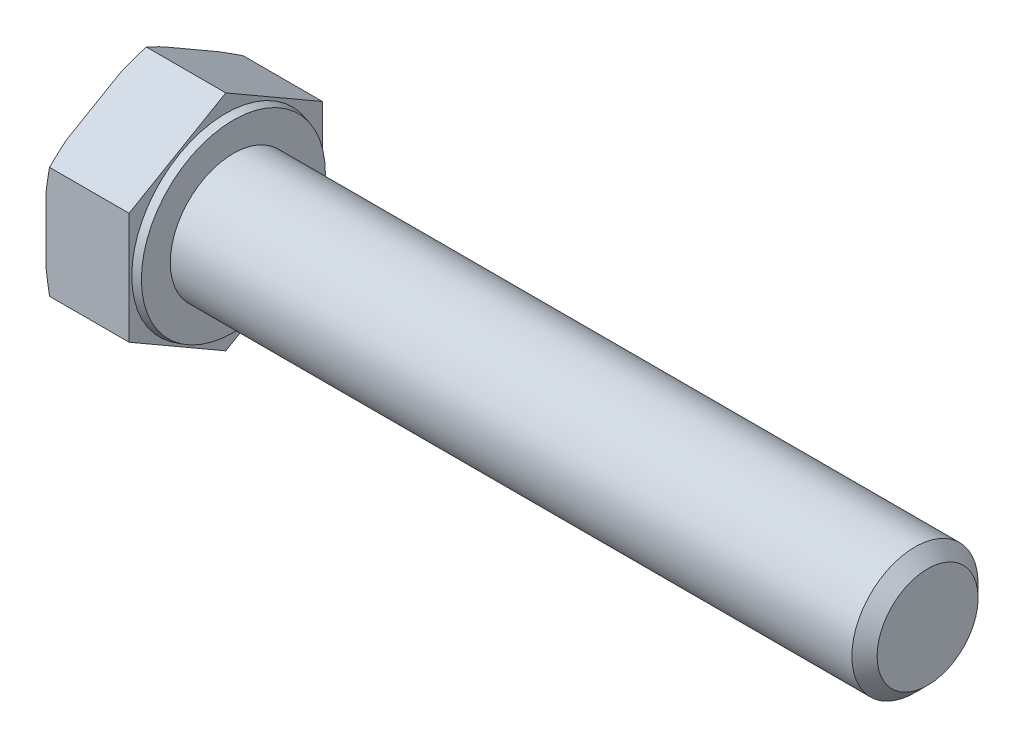
ISO-10303-21;
HEADER;
FILE_DESCRIPTION(('STEP AP214'),'2;1');
FILE_NAME('part.step','',(''),(''),'','','');
FILE_SCHEMA(('AUTOMOTIVE_DESIGN { 1 0 10303 214 1 1 1 1 }'));
ENDSEC;
DATA;
#1=APPLICATION_CONTEXT('core data for automotive mechanical design processes');
#2=APPLICATION_PROTOCOL_DEFINITION('international standard','automotive_design',2000,#1);
#3=PRODUCT_CONTEXT('',#1,'mechanical');
#4=PRODUCT('Part','Part','',(#3));
#5=PRODUCT_RELATED_PRODUCT_CATEGORY('part','',(#4));
#6=PRODUCT_DEFINITION_FORMATION('','',#4);
#7=PRODUCT_DEFINITION_CONTEXT('part definition',#1,'design');
#8=PRODUCT_DEFINITION('design','',#6,#7);
#9=PRODUCT_DEFINITION_SHAPE('','',#8);
#10=(LENGTH_UNIT() NAMED_UNIT(*) SI_UNIT(.MILLI.,.METRE.));
#11=(NAMED_UNIT(*) PLANE_ANGLE_UNIT() SI_UNIT($,.RADIAN.));
#12=(NAMED_UNIT(*) SI_UNIT($,.STERADIAN.) SOLID_ANGLE_UNIT());
#13=UNCERTAINTY_MEASURE_WITH_UNIT(LENGTH_MEASURE(1.E-05),#10,'distance_accuracy_value','');
#14=(GEOMETRIC_REPRESENTATION_CONTEXT(3) GLOBAL_UNCERTAINTY_ASSIGNED_CONTEXT((#13)) GLOBAL_UNIT_ASSIGNED_CONTEXT((#10,
#11,#12)) REPRESENTATION_CONTEXT('',''));
#15=CARTESIAN_POINT('',(0.,0.,0.));
#16=DIRECTION('',(0.,0.,1.));
#17=DIRECTION('',(1.,0.,0.));
#18=AXIS2_PLACEMENT_3D('',#15,#16,#17);
#19=CARTESIAN_POINT('',(55.6000000000001,-4.42500000000009,-7.66432482349223));
#20=DIRECTION('',(0.,-0.866025403784441,-0.499999999999995));
#21=DIRECTION('',(0.,0.499999999999995,-0.866025403784442));
#22=AXIS2_PLACEMENT_3D('',#19,#20,#21);
#23=PLANE('',#22);
#24=DIRECTION('',(-1.,0.,0.));
#25=VECTOR('',#24,1.);
#26=CARTESIAN_POINT('',(55.6000000000001,-8.85,0.));
#27=LINE('',#26,#25);
#28=CARTESIAN_POINT('',(0.,-8.85,0.));
#29=VERTEX_POINT('',#28);
#30=CARTESIAN_POINT('',(-6.29792306844368,-8.85,0.));
#31=VERTEX_POINT('',#30);
#32=EDGE_CURVE('E158',#29,#31,#27,.T.);
#33=ORIENTED_EDGE('',*,*,#32,.T.);
#34=CARTESIAN_POINT('',(-4.7699615006699,-11.9174022332107,5.3128965151713));
#35=CARTESIAN_POINT('',(-4.83614833570257,-11.8050473190038,5.11829209528478));
#36=CARTESIAN_POINT('',(-4.90167255003095,-11.6925948603644,4.92351872348535));
#37=CARTESIAN_POINT('',(-5.03118559698242,-11.4674663528304,4.53358471020429));
#38=CARTESIAN_POINT('',(-5.09517439305191,-11.3547902986816,4.33842405962226));
#39=CARTESIAN_POINT('',(-5.28456041407139,-11.0163157536771,3.75216895060564));
#40=CARTESIAN_POINT('',(-5.40733223857273,-10.7901468045143,3.3604328395613));
#41=CARTESIAN_POINT('',(-5.64480594732521,-10.3342684187143,2.57082831328319));
#42=CARTESIAN_POINT('',(-5.75941225873481,-10.1045464495324,2.17293819104532));
#43=CARTESIAN_POINT('',(-5.97591685440881,-9.6436033227612,1.37456127607789));
#44=CARTESIAN_POINT('',(-6.07781581130404,-9.41238224520544,0.974074621970503));
#45=CARTESIAN_POINT('',(-6.26134144326315,-8.95638364479248,0.184261877874948));
#46=CARTESIAN_POINT('',(-6.34355573274743,-8.73166601658844,-0.204960471530832));
#47=CARTESIAN_POINT('',(-6.48746045966098,-8.28055127837509,-0.986314118159494));
#48=CARTESIAN_POINT('',(-6.54915189984519,-8.05415425097466,-1.37844527229961));
#49=CARTESIAN_POINT('',(-6.62254434564547,-7.71410474496151,-1.9674282938031));
#50=CARTESIAN_POINT('',(-6.64378861584913,-7.60095958105454,-2.16340146632069));
#51=CARTESIAN_POINT('',(-6.67950592063896,-7.37440457175731,-2.55580625313272));
#52=CARTESIAN_POINT('',(-6.69397933196105,-7.26099474144627,-2.75223784130922));
#53=CARTESIAN_POINT('',(-6.7157765759338,-7.03401139991638,-3.14538452131075));
#54=CARTESIAN_POINT('',(-6.72310096885371,-6.92043790222291,-3.34209958970915));
#55=CARTESIAN_POINT('',(-6.73040192529393,-6.69323186195545,-3.73563199523894));
#56=CARTESIAN_POINT('',(-6.73037853713207,-6.57959931977464,-3.93244933168932));
#57=CARTESIAN_POINT('',(-6.72320871548941,-6.35929562962563,-4.31402651612232));
#58=CARTESIAN_POINT('',(-6.71649505277964,-6.25262090601261,-4.49879255730344));
#59=CARTESIAN_POINT('',(-6.69675463432834,-6.03941600442701,-4.86807427927243));
#60=CARTESIAN_POINT('',(-6.68372760236287,-5.93288583298343,-5.05258994875172));
#61=CARTESIAN_POINT('',(-6.63559663675346,-5.61363013252953,-5.60555704254388));
#62=CARTESIAN_POINT('',(-6.59144268713134,-5.40123548697151,-5.97343535990596));
#63=CARTESIAN_POINT('',(-6.48226269320506,-4.97681311893132,-6.70855646522027));
#64=CARTESIAN_POINT('',(-6.41713860156276,-4.7647919199632,-7.07578795411474));
#65=CARTESIAN_POINT('',(-6.27018625376656,-4.34222339340586,-7.80769811179158));
#66=CARTESIAN_POINT('',(-6.18835790112246,-4.1316760743376,-8.17237676581522));
#67=CARTESIAN_POINT('',(-6.00866271800198,-3.70472589760515,-8.91187616421634));
#68=CARTESIAN_POINT('',(-5.91033992742069,-3.48837165185492,-9.286612710289));
#69=CARTESIAN_POINT('',(-5.70311989656312,-3.05693413716248,-10.0338844060276));
#70=CARTESIAN_POINT('',(-5.59422212603359,-2.84185093252738,-10.4064194443103));
#71=CARTESIAN_POINT('',(-5.36943684134144,-2.41473283183158,-11.1462096955477));
#72=CARTESIAN_POINT('',(-5.25362330968472,-2.2026881429877,-11.5134818701005));
#73=CARTESIAN_POINT('',(-5.07537550670142,-1.88529185166038,-12.0632283728133));
#74=CARTESIAN_POINT('',(-5.01521325258259,-1.77961882394802,-12.2462594258008));
#75=CARTESIAN_POINT('',(-4.89354912869936,-1.56846779942573,-12.6119837283436));
#76=CARTESIAN_POINT('',(-4.83204728425027,-1.462989798971,-12.794676984212));
#77=CARTESIAN_POINT('',(-4.7699615006699,-1.35759776678936,-12.9772213386635));
#78=B_SPLINE_CURVE_WITH_KNOTS('',3,(#34,#35,#36,#37,#38,#39,#40,#41,#42,#43,#44,#45,#46,#47,#48,
#49,#50,#51,#52,#53,#54,#55,#56,#57,#58,#59,#60,#61,#62,#63,#64,#65,#66,#67,#68,#69,#70,#71,#72,
#73,#74,#75,#76,#77),.UNSPECIFIED.,.F.,.F.,(4,2,2,2,2,2,2,2,2,2,2,2,2,2,2,2,2,2,2,2,2,4),(0.,
0.70276173034238,1.40554017472233,2.81157217612387,4.23201032618944,5.6523732571052,
7.02270828812482,8.39297635416767,9.07474696516834,9.75647963740092,10.438158877887,
11.119833635759,11.7601005309412,12.4003954417532,13.6809617128842,14.9676044823533,
16.2542546841745,17.5852978857349,18.9164078632869,20.2352036230902,20.894426976119,
21.553637882061),.UNSPECIFIED.);
#79=CARTESIAN_POINT('',(-6.58000000000003,-7.90869530364146,-1.63038755949604));
#80=VERTEX_POINT('',#79);
#81=EDGE_CURVE('E203',#31,#80,#78,.T.);
#82=ORIENTED_EDGE('',*,*,#81,.T.);
#83=DIRECTION('',(0.,-0.499999999999995,0.866025403784442));
#84=VECTOR('',#83,1.);
#85=CARTESIAN_POINT('',(-6.58,-4.42500000000009,-7.66432482349223));
#86=LINE('',#85,#84);
#87=CARTESIAN_POINT('',(-6.58,-5.36630469635854,-6.03393726399618));
#88=VERTEX_POINT('',#87);
#89=EDGE_CURVE('E213',#88,#80,#86,.T.);
#90=ORIENTED_EDGE('',*,*,#89,.F.);
#91=CARTESIAN_POINT('',(-6.29792306844368,-4.42500000000009,-7.66432482349223));
#92=VERTEX_POINT('',#91);
#93=EDGE_CURVE('E216',#88,#92,#78,.T.);
#94=ORIENTED_EDGE('',*,*,#93,.T.);
#95=DIRECTION('',(-1.,0.,0.));
#96=VECTOR('',#95,1.);
#97=CARTESIAN_POINT('',(55.6000000000001,-4.42500000000009,-7.66432482349223));
#98=LINE('',#97,#96);
#99=CARTESIAN_POINT('',(0.,-4.42500000000009,-7.66432482349223));
#100=VERTEX_POINT('',#99);
#101=EDGE_CURVE('E169',#100,#92,#98,.T.);
#102=ORIENTED_EDGE('',*,*,#101,.F.);
#103=DIRECTION('',(0.,-0.499999999999995,0.866025403784442));
#104=VECTOR('',#103,1.);
#105=CARTESIAN_POINT('',(0.,-4.42500000000009,-7.66432482349223));
#106=LINE('',#105,#104);
#107=EDGE_CURVE('E184',#100,#29,#106,.T.);
#108=ORIENTED_EDGE('',*,*,#107,.T.);
#109=EDGE_LOOP('',(#33,#82,#90,#94,#102,#108));
#110=FACE_BOUND('',#109,.T.);
#111=ADVANCED_FACE('F36',(#110),#23,.T.);
#112=CARTESIAN_POINT('',(55.6000000000001,4.42499999999993,-7.66432482349232));
#113=DIRECTION('',(0.,0.,-1.));
#114=DIRECTION('',(0.,1.,0.));
#115=AXIS2_PLACEMENT_3D('',#112,#113,#114);
#116=PLANE('',#115);
#117=ORIENTED_EDGE('',*,*,#101,.T.);
#118=CARTESIAN_POINT('',(-5.00864005639831,-9.73789651517145,-7.66432482349217));
#119=CARTESIAN_POINT('',(-5.07003318744064,-9.52322769233334,-7.66432482349218));
#120=CARTESIAN_POINT('',(-5.13071664914256,-9.30835600664128,-7.66432482349218));
#121=CARTESIAN_POINT('',(-5.2504442425723,-8.87815277711283,-7.66432482349218));
#122=CARTESIAN_POINT('',(-5.30948834652955,-8.66282122555281,-7.66432482349219));
#123=CARTESIAN_POINT('',(-5.48387527888684,-8.01589307910885,-7.66432482349219));
#124=CARTESIAN_POINT('',(-5.59642298983084,-7.58353558067021,-7.6643248234922));
#125=CARTESIAN_POINT('',(-5.81266226723173,-6.71259000391773,-7.66432482349221));
#126=CARTESIAN_POINT('',(-5.91626806915323,-6.27398046842187,-7.66432482349221));
#127=CARTESIAN_POINT('',(-6.11029091280608,-5.39384656433909,-7.66432482349222));
#128=CARTESIAN_POINT('',(-6.20070892550878,-4.95232241284974,-7.66432482349222));
#129=CARTESIAN_POINT('',(-6.36160933963008,-4.08051166755351,-7.66432482349223));
#130=CARTESIAN_POINT('',(-6.43264625776086,-3.65032885049375,-7.66432482349224));
#131=CARTESIAN_POINT('',(-6.55428187483288,-2.78707107422335,-7.66432482349225));
#132=CARTESIAN_POINT('',(-6.60488453148917,-2.35399669158535,-7.66432482349225));
#133=CARTESIAN_POINT('',(-6.66240831794471,-1.70368188145931,-7.66432482349226));
#134=CARTESIAN_POINT('',(-6.67850532779577,-1.48723464984804,-7.66432482349226));
#135=CARTESIAN_POINT('',(-6.70429433272965,-1.05396299728827,-7.66432482349227));
#136=CARTESIAN_POINT('',(-6.71398664875919,-0.837138595786226,-7.66432482349227));
#137=CARTESIAN_POINT('',(-6.72672253024382,-0.403302294793051,-7.66432482349227));
#138=CARTESIAN_POINT('',(-6.72976638437883,-0.186290403852155,-7.66432482349227));
#139=CARTESIAN_POINT('',(-6.7291358967764,0.247718950123678,-7.66432482349228));
#140=CARTESIAN_POINT('',(-6.72546155695146,0.464716413162706,-7.66432482349228));
#141=CARTESIAN_POINT('',(-6.70624362970486,1.06036953223341,-7.66432482349229));
#142=CARTESIAN_POINT('',(-6.68388895075078,1.43882252598365,-7.66432482349229));
#143=CARTESIAN_POINT('',(-6.62050559151052,2.19412494594648,-7.6643248234923));
#144=CARTESIAN_POINT('',(-6.57947609181733,2.57097430106276,-7.6643248234923));
#145=CARTESIAN_POINT('',(-6.48113797206862,3.32388976987407,-7.66432482349231));
#146=CARTESIAN_POINT('',(-6.4237712185853,3.69994816672772,-7.66432482349232));
#147=CARTESIAN_POINT('',(-6.2956564145037,4.44978573942378,-7.66432482349232));
#148=CARTESIAN_POINT('',(-6.22490691200718,4.82356466341955,-7.66432482349233));
#149=CARTESIAN_POINT('',(-6.0704014797458,5.58003633732887,-7.66432482349234));
#150=CARTESIAN_POINT('',(-5.98632024183774,5.96266195818458,-7.66432482349234));
#151=CARTESIAN_POINT('',(-5.80919867667365,6.72583533235177,-7.66432482349235));
#152=CARTESIAN_POINT('',(-5.71615790531566,7.10638298167437,-7.66432482349235));
#153=CARTESIAN_POINT('',(-5.52374117974904,7.86297645537245,-7.66432482349236));
#154=CARTESIAN_POINT('',(-5.42441511026811,8.23903503370974,-7.66432482349236));
#155=CARTESIAN_POINT('',(-5.27134102225385,8.80195695976291,-7.66432482349237));
#156=CARTESIAN_POINT('',(-5.21964171692946,8.98938164843282,-7.66432482349237));
#157=CARTESIAN_POINT('',(-5.11502150400523,9.36388780999383,-7.66432482349237));
#158=CARTESIAN_POINT('',(-5.06210060924165,9.55096928646908,-7.66432482349238));
#159=CARTESIAN_POINT('',(-5.00864005639831,9.73789651517129,-7.66432482349238));
#160=B_SPLINE_CURVE_WITH_KNOTS('',3,(#118,#119,#120,#121,#122,#123,#124,#125,#126,#127,#128,
#129,#130,#131,#132,#133,#134,#135,#136,#137,#138,#139,#140,#141,#142,#143,#144,#145,#146,#147,
#148,#149,#150,#151,#152,#153,#154,#155,#156,#157,#158,#159),.UNSPECIFIED.,.F.,.F.,(4,2,2,2,2,2,
2,2,2,2,2,2,2,2,2,2,2,2,2,2,4),(0.,0.669823290546161,1.33965792092904,2.67986595636369,
4.03175825312792,5.38355096443301,6.69120700403605,7.99860965473741,8.64966414612008,
9.300686009923,9.95167960543101,10.6026730156168,11.7394565125237,12.876289893615,
14.0172201663474,15.1582742899967,16.3334026116279,17.5085892114817,18.6753990362947,
19.2586689197893,19.8419326771629),.UNSPECIFIED.);
#161=CARTESIAN_POINT('',(-6.58000000000003,-2.54239060728318,-7.66432482349217));
#162=VERTEX_POINT('',#161);
#163=EDGE_CURVE('E224',#92,#162,#160,.T.);
#164=ORIENTED_EDGE('',*,*,#163,.T.);
#165=DIRECTION('',(0.,-1.,0.));
#166=VECTOR('',#165,1.);
#167=CARTESIAN_POINT('',(-6.58,4.42499999999993,-7.66432482349232));
#168=LINE('',#167,#166);
#169=CARTESIAN_POINT('',(-6.58,2.54239060728305,-7.6643248234923));
#170=VERTEX_POINT('',#169);
#171=EDGE_CURVE('E164',#170,#162,#168,.T.);
#172=ORIENTED_EDGE('',*,*,#171,.F.);
#173=CARTESIAN_POINT('',(-6.29792306844368,4.42499999999993,-7.66432482349232));
#174=VERTEX_POINT('',#173);
#175=EDGE_CURVE('E51',#170,#174,#160,.T.);
#176=ORIENTED_EDGE('',*,*,#175,.T.);
#177=DIRECTION('',(-1.,0.,0.));
#178=VECTOR('',#177,1.);
#179=CARTESIAN_POINT('',(55.6000000000001,4.42499999999993,-7.66432482349232));
#180=LINE('',#179,#178);
#181=CARTESIAN_POINT('',(0.,4.42499999999993,-7.66432482349232));
#182=VERTEX_POINT('',#181);
#183=EDGE_CURVE('E155',#182,#174,#180,.T.);
#184=ORIENTED_EDGE('',*,*,#183,.F.);
#185=DIRECTION('',(0.,-1.,0.));
#186=VECTOR('',#185,1.);
#187=CARTESIAN_POINT('',(0.,8.84999999999992,-7.66432482349237));
#188=LINE('',#187,#186);
#189=EDGE_CURVE('E182',#182,#100,#188,.T.);
#190=ORIENTED_EDGE('',*,*,#189,.T.);
#191=EDGE_LOOP('',(#117,#164,#172,#176,#184,#190));
#192=FACE_BOUND('',#191,.T.);
#193=ADVANCED_FACE('F251',(#192),#116,.T.);
#194=CARTESIAN_POINT('',(55.6000000000001,8.85,0.));
#195=DIRECTION('',(0.,0.866025403784435,-0.500000000000007));
#196=DIRECTION('',(0.,0.500000000000007,0.866025403784434));
#197=AXIS2_PLACEMENT_3D('',#194,#195,#196);
#198=PLANE('',#197);
#199=ORIENTED_EDGE('',*,*,#183,.T.);
#200=CARTESIAN_POINT('',(-4.76996150066986,1.35759776678906,-12.9772213386637));
#201=CARTESIAN_POINT('',(-4.83614833570253,1.46995268099604,-12.7826169187772));
#202=CARTESIAN_POINT('',(-4.90167255003091,1.58240513963541,-12.5878435469777));
#203=CARTESIAN_POINT('',(-5.03118559698238,1.80753364716943,-12.1979095336967));
#204=CARTESIAN_POINT('',(-5.09517439305187,1.92020970131819,-12.0027488831146));
#205=CARTESIAN_POINT('',(-5.28456041407135,2.25868424632273,-11.416493774098));
#206=CARTESIAN_POINT('',(-5.40733223857269,2.48485319548548,-11.0247576630537));
#207=CARTESIAN_POINT('',(-5.64480594732518,2.94073158128551,-10.2351531367756));
#208=CARTESIAN_POINT('',(-5.75941225873478,3.17045355046743,-9.83726301453771));
#209=CARTESIAN_POINT('',(-5.97591685440879,3.63139667723867,-9.03888609957028));
#210=CARTESIAN_POINT('',(-6.07781581130402,3.86261775479443,-8.63839944546289));
#211=CARTESIAN_POINT('',(-6.26134144326313,4.31861635520741,-7.84858670136733));
#212=CARTESIAN_POINT('',(-6.34355573274742,4.54333398341145,-7.45936435196155));
#213=CARTESIAN_POINT('',(-6.48746045966097,4.99444872162482,-6.67801070533289));
#214=CARTESIAN_POINT('',(-6.54915189984519,5.22084574902526,-6.28587955119277));
#215=CARTESIAN_POINT('',(-6.62254434564547,5.56089525503842,-5.69689652968929));
#216=CARTESIAN_POINT('',(-6.64378861584913,5.6740404189454,-5.5009233571717));
#217=CARTESIAN_POINT('',(-6.67950592063896,5.90059542824263,-5.10851857035966));
#218=CARTESIAN_POINT('',(-6.69397933196106,6.01400525855368,-4.91208698218316));
#219=CARTESIAN_POINT('',(-6.7157765759338,6.24098860008357,-4.51894030218163));
#220=CARTESIAN_POINT('',(-6.72310096885372,6.35456209777704,-4.32222523378324));
#221=CARTESIAN_POINT('',(-6.73040192529394,6.58176813804451,-3.92869282825345));
#222=CARTESIAN_POINT('',(-6.73037853713208,6.69540068022533,-3.73187549180306));
#223=CARTESIAN_POINT('',(-6.72320871548943,6.91570437037435,-3.35029830737006));
#224=CARTESIAN_POINT('',(-6.71649505277966,7.02237909398737,-3.16553226618894));
#225=CARTESIAN_POINT('',(-6.69675463432836,7.23558399557298,-2.79625054421994));
#226=CARTESIAN_POINT('',(-6.68372760236289,7.34211416701656,-2.61173487474064));
#227=CARTESIAN_POINT('',(-6.63559663675348,7.66136986747048,-2.05876778094847));
#228=CARTESIAN_POINT('',(-6.59144268713136,7.87376451302851,-1.69088946358639));
#229=CARTESIAN_POINT('',(-6.48226269320508,8.29818688106872,-0.955768358272067));
#230=CARTESIAN_POINT('',(-6.41713860156277,8.51020808003686,-0.588536869377595));
#231=CARTESIAN_POINT('',(-6.27018625376657,8.93277660659422,0.143373288299261));
#232=CARTESIAN_POINT('',(-6.18835790112246,9.14332392566248,0.508051942322905));
#233=CARTESIAN_POINT('',(-6.00866271800198,9.57027410239495,1.24755134072404));
#234=CARTESIAN_POINT('',(-5.91033992742068,9.7866283481452,1.62228788679671));
#235=CARTESIAN_POINT('',(-5.7031198965631,10.2180658628377,2.36955958253528));
#236=CARTESIAN_POINT('',(-5.59422212603357,10.4331490674728,2.74209462081801));
#237=CARTESIAN_POINT('',(-5.36943684134141,10.8602671681686,3.48188487205548));
#238=CARTESIAN_POINT('',(-5.25362330968469,11.0723118570125,3.84915704660823));
#239=CARTESIAN_POINT('',(-5.07537550670138,11.3897081483398,4.39890354932111));
#240=CARTESIAN_POINT('',(-5.01521325258256,11.4953811760522,4.58193460230855));
#241=CARTESIAN_POINT('',(-4.89354912869932,11.7065322005745,4.94765890485139));
#242=CARTESIAN_POINT('',(-4.83204728425022,11.8120102010292,5.13035216071975));
#243=CARTESIAN_POINT('',(-4.76996150066986,11.9174022332109,5.3128965151713));
#244=B_SPLINE_CURVE_WITH_KNOTS('',3,(#200,#201,#202,#203,#204,#205,#206,#207,#208,#209,#210,
#211,#212,#213,#214,#215,#216,#217,#218,#219,#220,#221,#222,#223,#224,#225,#226,#227,#228,#229,
#230,#231,#232,#233,#234,#235,#236,#237,#238,#239,#240,#241,#242,#243),.UNSPECIFIED.,.F.,.F.,(4,
2,2,2,2,2,2,2,2,2,2,2,2,2,2,2,2,2,2,2,2,4),(0.,0.702761730342389,1.40554017472235,
2.8115721761239,4.23201032618948,5.65237325710526,7.02270828812488,8.39297635416774,
9.07474696516842,9.75647963740101,10.4381588778871,11.1198336357591,11.7601005309413,
12.4003954417533,13.6809617128843,14.9676044823535,16.2542546841748,17.5852978857351,
18.9164078632872,20.2352036230905,20.8944269761194,21.5536378820614),.UNSPECIFIED.);
#245=CARTESIAN_POINT('',(-6.58000000000003,5.36630469635833,-6.03393726399625));
#246=VERTEX_POINT('',#245);
#247=EDGE_CURVE('E246',#174,#246,#244,.T.);
#248=ORIENTED_EDGE('',*,*,#247,.T.);
#249=DIRECTION('',(0.,-0.500000000000007,-0.866025403784435));
#250=VECTOR('',#249,1.);
#251=CARTESIAN_POINT('',(-6.58,8.85,0.));
#252=LINE('',#251,#250);
#253=CARTESIAN_POINT('',(-6.58,7.90869530364155,-1.63038755949607));
#254=VERTEX_POINT('',#253);
#255=EDGE_CURVE('E236',#254,#246,#252,.T.);
#256=ORIENTED_EDGE('',*,*,#255,.F.);
#257=CARTESIAN_POINT('',(-6.29792306844368,8.85,0.));
#258=VERTEX_POINT('',#257);
#259=EDGE_CURVE('E59',#254,#258,#244,.T.);
#260=ORIENTED_EDGE('',*,*,#259,.T.);
#261=DIRECTION('',(-1.,0.,0.));
#262=VECTOR('',#261,1.);
#263=CARTESIAN_POINT('',(55.6000000000001,8.85,0.));
#264=LINE('',#263,#262);
#265=CARTESIAN_POINT('',(0.,8.85,0.));
#266=VERTEX_POINT('',#265);
#267=EDGE_CURVE('E152',#266,#258,#264,.T.);
#268=ORIENTED_EDGE('',*,*,#267,.F.);
#269=DIRECTION('',(0.,-0.500000000000007,-0.866025403784434));
#270=VECTOR('',#269,1.);
#271=CARTESIAN_POINT('',(0.,8.85000000000003,0.));
#272=LINE('',#271,#270);
#273=EDGE_CURVE('E180',#266,#182,#272,.T.);
#274=ORIENTED_EDGE('',*,*,#273,.T.);
#275=EDGE_LOOP('',(#199,#248,#256,#260,#268,#274));
#276=FACE_BOUND('',#275,.T.);
#277=ADVANCED_FACE('F244',(#276),#198,.T.);
#278=CARTESIAN_POINT('',(55.6000000000001,4.42500000000004,7.66432482349226));
#279=DIRECTION('',(0.,0.866025403784441,0.499999999999995));
#280=DIRECTION('',(0.,-0.499999999999995,0.866025403784442));
#281=AXIS2_PLACEMENT_3D('',#278,#279,#280);
#282=PLANE('',#281);
#283=ORIENTED_EDGE('',*,*,#267,.T.);
#284=CARTESIAN_POINT('',(-4.76996150066987,11.9174022332108,-5.31289651517143));
#285=CARTESIAN_POINT('',(-4.83614833570254,11.8050473190038,-5.1182920952849));
#286=CARTESIAN_POINT('',(-4.90167255003092,11.6925948603644,-4.92351872348547));
#287=CARTESIAN_POINT('',(-5.03118559698239,11.4674663528304,-4.53358471020441));
#288=CARTESIAN_POINT('',(-5.09517439305188,11.3547902986817,-4.33842405962238));
#289=CARTESIAN_POINT('',(-5.28456041407136,11.0163157536771,-3.75216895060575));
#290=CARTESIAN_POINT('',(-5.40733223857271,10.7901468045144,-3.36043283956142));
#291=CARTESIAN_POINT('',(-5.64480594732519,10.3342684187144,-2.5708283132833));
#292=CARTESIAN_POINT('',(-5.75941225873479,10.1045464495324,-2.17293819104544));
#293=CARTESIAN_POINT('',(-5.9759168544088,9.64360332276122,-1.374561276078));
#294=CARTESIAN_POINT('',(-6.07781581130403,9.41238224520547,-0.974074621970606));
#295=CARTESIAN_POINT('',(-6.26134144326314,8.95638364479251,-0.184261877875046));
#296=CARTESIAN_POINT('',(-6.34355573274742,8.73166601658846,0.204960471530735));
#297=CARTESIAN_POINT('',(-6.48746045966097,8.28055127837511,0.986314118159402));
#298=CARTESIAN_POINT('',(-6.54915189984519,8.05415425097468,1.37844527229952));
#299=CARTESIAN_POINT('',(-6.62254434564547,7.71410474496153,1.96742829380301));
#300=CARTESIAN_POINT('',(-6.64378861584914,7.60095958105455,2.1634014663206));
#301=CARTESIAN_POINT('',(-6.67950592063896,7.37440457175733,2.55580625313264));
#302=CARTESIAN_POINT('',(-6.69397933196106,7.26099474144628,2.75223784130914));
#303=CARTESIAN_POINT('',(-6.7157765759338,7.03401139991639,3.14538452131067));
#304=CARTESIAN_POINT('',(-6.72310096885372,6.92043790222292,3.34209958970907));
#305=CARTESIAN_POINT('',(-6.73040192529394,6.69323186195546,3.73563199523886));
#306=CARTESIAN_POINT('',(-6.73037853713208,6.57959931977464,3.93244933168925));
#307=CARTESIAN_POINT('',(-6.72320871548943,6.35929562962563,4.31402651612225));
#308=CARTESIAN_POINT('',(-6.71649505277966,6.25262090601261,4.49879255730337));
#309=CARTESIAN_POINT('',(-6.69675463432836,6.03941600442701,4.86807427927237));
#310=CARTESIAN_POINT('',(-6.68372760236289,5.93288583298343,5.05258994875167));
#311=CARTESIAN_POINT('',(-6.63559663675348,5.61363013252952,5.60555704254384));
#312=CARTESIAN_POINT('',(-6.59144268713136,5.40123548697149,5.97343535990593));
#313=CARTESIAN_POINT('',(-6.48226269320508,4.9768131189313,6.70855646522025));
#314=CARTESIAN_POINT('',(-6.41713860156277,4.76479191996317,7.07578795411472));
#315=CARTESIAN_POINT('',(-6.27018625376657,4.34222339340582,7.80769811179158));
#316=CARTESIAN_POINT('',(-6.18835790112247,4.13167607433757,8.17237676581522));
#317=CARTESIAN_POINT('',(-6.00866271800198,3.70472589760511,8.91187616421636));
#318=CARTESIAN_POINT('',(-5.91033992742069,3.48837165185487,9.28661271028903));
#319=CARTESIAN_POINT('',(-5.70311989656311,3.05693413716242,10.0338844060276));
#320=CARTESIAN_POINT('',(-5.59422212603358,2.84185093252732,10.4064194443103));
#321=CARTESIAN_POINT('',(-5.36943684134142,2.41473283183151,11.1462096955478));
#322=CARTESIAN_POINT('',(-5.2536233096847,2.20268814298763,11.5134818701005));
#323=CARTESIAN_POINT('',(-5.07537550670139,1.88529185166029,12.0632283728134));
#324=CARTESIAN_POINT('',(-5.01521325258257,1.77961882394794,12.2462594258009));
#325=CARTESIAN_POINT('',(-4.89354912869933,1.56846779942564,12.6119837283437));
#326=CARTESIAN_POINT('',(-4.83204728425024,1.46298979897091,12.7946769842121));
#327=CARTESIAN_POINT('',(-4.76996150066987,1.35759776678927,12.9772213386636));
#328=B_SPLINE_CURVE_WITH_KNOTS('',3,(#284,#285,#286,#287,#288,#289,#290,#291,#292,#293,#294,
#295,#296,#297,#298,#299,#300,#301,#302,#303,#304,#305,#306,#307,#308,#309,#310,#311,#312,#313,
#314,#315,#316,#317,#318,#319,#320,#321,#322,#323,#324,#325,#326,#327),.UNSPECIFIED.,.F.,.F.,(4,
2,2,2,2,2,2,2,2,2,2,2,2,2,2,2,2,2,2,2,2,4),(0.,0.702761730342385,1.40554017472234,
2.81157217612389,4.23201032618946,5.65237325710524,7.02270828812486,8.39297635416772,
9.07474696516839,9.75647963740098,10.4381588778871,11.119833635759,11.7601005309412,
12.4003954417533,13.6809617128843,14.9676044823535,16.2542546841747,17.585297885735,
18.9164078632871,20.2352036230904,20.8944269761193,21.5536378820612),.UNSPECIFIED.);
#329=CARTESIAN_POINT('',(-6.58000000000003,7.90869530364148,1.63038755949594));
#330=VERTEX_POINT('',#329);
#331=EDGE_CURVE('E146',#258,#330,#328,.T.);
#332=ORIENTED_EDGE('',*,*,#331,.T.);
#333=DIRECTION('',(0.,0.499999999999995,-0.866025403784442));
#334=VECTOR('',#333,1.);
#335=CARTESIAN_POINT('',(-6.58,4.42500000000004,7.66432482349226));
#336=LINE('',#335,#334);
#337=CARTESIAN_POINT('',(-6.58,5.36630469635847,6.03393726399624));
#338=VERTEX_POINT('',#337);
#339=EDGE_CURVE('E145',#338,#330,#336,.T.);
#340=ORIENTED_EDGE('',*,*,#339,.F.);
#341=CARTESIAN_POINT('',(-6.29792306844368,4.42500000000004,7.66432482349226));
#342=VERTEX_POINT('',#341);
#343=EDGE_CURVE('E127',#338,#342,#328,.T.);
#344=ORIENTED_EDGE('',*,*,#343,.T.);
#345=DIRECTION('',(-1.,0.,0.));
#346=VECTOR('',#345,1.);
#347=CARTESIAN_POINT('',(55.6000000000001,4.42500000000004,7.66432482349226));
#348=LINE('',#347,#346);
#349=CARTESIAN_POINT('',(0.,4.42500000000004,7.66432482349226));
#350=VERTEX_POINT('',#349);
#351=EDGE_CURVE('E141',#350,#342,#348,.T.);
#352=ORIENTED_EDGE('',*,*,#351,.F.);
#353=DIRECTION('',(0.,0.499999999999995,-0.866025403784442));
#354=VECTOR('',#353,1.);
#355=CARTESIAN_POINT('',(0.,8.84999999999997,0.));
#356=LINE('',#355,#354);
#357=EDGE_CURVE('E178',#350,#266,#356,.T.);
#358=ORIENTED_EDGE('',*,*,#357,.T.);
#359=EDGE_LOOP('',(#283,#332,#340,#344,#352,#358));
#360=FACE_BOUND('',#359,.T.);
#361=ADVANCED_FACE('F140',(#360),#282,.T.);
#362=CARTESIAN_POINT('',(55.6000000000001,-4.42499999999998,7.66432482349229));
#363=DIRECTION('',(0.,0.,1.));
#364=DIRECTION('',(0.,-1.,0.));
#365=AXIS2_PLACEMENT_3D('',#362,#363,#364);
#366=PLANE('',#365);
#367=ORIENTED_EDGE('',*,*,#351,.T.);
#368=CARTESIAN_POINT('',(-5.00864005639831,9.7378965151714,7.66432482349224));
#369=CARTESIAN_POINT('',(-5.07003318744064,9.52322769233328,7.66432482349224));
#370=CARTESIAN_POINT('',(-5.13071664914256,9.30835600664122,7.66432482349224));
#371=CARTESIAN_POINT('',(-5.2504442425723,8.87815277711278,7.66432482349225));
#372=CARTESIAN_POINT('',(-5.30948834652955,8.66282122555276,7.66432482349225));
#373=CARTESIAN_POINT('',(-5.48387527888684,8.0158930791088,7.66432482349225));
#374=CARTESIAN_POINT('',(-5.59642298983084,7.58353558067016,7.66432482349225));
#375=CARTESIAN_POINT('',(-5.81266226723173,6.71259000391768,7.66432482349225));
#376=CARTESIAN_POINT('',(-5.91626806915323,6.27398046842182,7.66432482349225));
#377=CARTESIAN_POINT('',(-6.11029091280608,5.39384656433903,7.66432482349226));
#378=CARTESIAN_POINT('',(-6.20070892550878,4.95232241284969,7.66432482349226));
#379=CARTESIAN_POINT('',(-6.36160933963008,4.08051166755345,7.66432482349226));
#380=CARTESIAN_POINT('',(-6.43264625776087,3.6503288504937,7.66432482349226));
#381=CARTESIAN_POINT('',(-6.55428187483288,2.7870710742233,7.66432482349227));
#382=CARTESIAN_POINT('',(-6.60488453148917,2.3539966915853,7.66432482349227));
#383=CARTESIAN_POINT('',(-6.66240831794471,1.70368188145926,7.66432482349227));
#384=CARTESIAN_POINT('',(-6.67850532779577,1.48723464984798,7.66432482349227));
#385=CARTESIAN_POINT('',(-6.70429433272965,1.05396299728821,7.66432482349227));
#386=CARTESIAN_POINT('',(-6.71398664875919,0.83713859578617,7.66432482349227));
#387=CARTESIAN_POINT('',(-6.72672253024382,0.403302294792995,7.66432482349227));
#388=CARTESIAN_POINT('',(-6.72976638437883,0.1862904038521,7.66432482349228));
#389=CARTESIAN_POINT('',(-6.7291358967764,-0.247718950123733,7.66432482349228));
#390=CARTESIAN_POINT('',(-6.72546155695146,-0.46471641316276,7.66432482349228));
#391=CARTESIAN_POINT('',(-6.70624362970486,-1.06036953223346,7.66432482349228));
#392=CARTESIAN_POINT('',(-6.68388895075078,-1.43882252598371,7.66432482349228));
#393=CARTESIAN_POINT('',(-6.62050559151052,-2.19412494594653,7.66432482349228));
#394=CARTESIAN_POINT('',(-6.57947609181733,-2.57097430106281,7.66432482349229));
#395=CARTESIAN_POINT('',(-6.48113797206862,-3.32388976987413,7.66432482349229));
#396=CARTESIAN_POINT('',(-6.4237712185853,-3.69994816672777,7.66432482349229));
#397=CARTESIAN_POINT('',(-6.2956564145037,-4.44978573942384,7.66432482349229));
#398=CARTESIAN_POINT('',(-6.22490691200718,-4.8235646634196,7.66432482349229));
#399=CARTESIAN_POINT('',(-6.0704014797458,-5.58003633732892,7.6643248234923));
#400=CARTESIAN_POINT('',(-5.98632024183774,-5.96266195818463,7.6643248234923));
#401=CARTESIAN_POINT('',(-5.80919867667365,-6.72583533235183,7.6643248234923));
#402=CARTESIAN_POINT('',(-5.71615790531566,-7.10638298167442,7.6643248234923));
#403=CARTESIAN_POINT('',(-5.52374117974904,-7.8629764553725,7.66432482349231));
#404=CARTESIAN_POINT('',(-5.42441511026811,-8.2390350337098,7.66432482349231));
#405=CARTESIAN_POINT('',(-5.27134102225385,-8.80195695976297,7.66432482349231));
#406=CARTESIAN_POINT('',(-5.21964171692946,-8.98938164843288,7.66432482349231));
#407=CARTESIAN_POINT('',(-5.11502150400523,-9.36388780999389,7.66432482349231));
#408=CARTESIAN_POINT('',(-5.06210060924165,-9.55096928646914,7.66432482349231));
#409=CARTESIAN_POINT('',(-5.00864005639831,-9.73789651517135,7.66432482349231));
#410=B_SPLINE_CURVE_WITH_KNOTS('',3,(#368,#369,#370,#371,#372,#373,#374,#375,#376,#377,#378,
#379,#380,#381,#382,#383,#384,#385,#386,#387,#388,#389,#390,#391,#392,#393,#394,#395,#396,#397,
#398,#399,#400,#401,#402,#403,#404,#405,#406,#407,#408,#409),.UNSPECIFIED.,.F.,.F.,(4,2,2,2,2,2,
2,2,2,2,2,2,2,2,2,2,2,2,2,2,4),(0.,0.669823290546161,1.33965792092904,2.67986595636369,
4.03175825312792,5.38355096443301,6.69120700403605,7.99860965473742,8.64966414612009,
9.300686009923,9.95167960543102,10.6026730156168,11.7394565125237,12.876289893615,
14.0172201663474,15.1582742899967,16.3334026116279,17.5085892114817,18.6753990362947,
19.2586689197893,19.8419326771629),.UNSPECIFIED.);
#411=CARTESIAN_POINT('',(-6.58000000000003,2.54239060728313,7.66432482349219));
#412=VERTEX_POINT('',#411);
#413=EDGE_CURVE('E124',#342,#412,#410,.T.);
#414=ORIENTED_EDGE('',*,*,#413,.T.);
#415=DIRECTION('',(0.,1.,0.));
#416=VECTOR('',#415,1.);
#417=CARTESIAN_POINT('',(-6.58,-4.42499999999998,7.66432482349229));
#418=LINE('',#417,#416);
#419=CARTESIAN_POINT('',(-6.58,-2.5423906072831,7.66432482349229));
#420=VERTEX_POINT('',#419);
#421=EDGE_CURVE('E222',#420,#412,#418,.T.);
#422=ORIENTED_EDGE('',*,*,#421,.F.);
#423=CARTESIAN_POINT('',(-6.29792306844368,-4.42499999999998,7.66432482349229));
#424=VERTEX_POINT('',#423);
#425=EDGE_CURVE('E134',#420,#424,#410,.T.);
#426=ORIENTED_EDGE('',*,*,#425,.T.);
#427=DIRECTION('',(-1.,0.,0.));
#428=VECTOR('',#427,1.);
#429=CARTESIAN_POINT('',(55.6000000000001,-4.42499999999998,7.66432482349229));
#430=LINE('',#429,#428);
#431=CARTESIAN_POINT('',(0.,-4.42499999999998,7.66432482349229));
#432=VERTEX_POINT('',#431);
#433=EDGE_CURVE('E153',#432,#424,#430,.T.);
#434=ORIENTED_EDGE('',*,*,#433,.F.);
#435=DIRECTION('',(0.,1.,0.));
#436=VECTOR('',#435,1.);
#437=CARTESIAN_POINT('',(0.,8.85000000000003,7.66432482349225));
#438=LINE('',#437,#436);
#439=EDGE_CURVE('E151',#432,#350,#438,.T.);
#440=ORIENTED_EDGE('',*,*,#439,.T.);
#441=EDGE_LOOP('',(#367,#414,#422,#426,#434,#440));
#442=FACE_BOUND('',#441,.T.);
#443=ADVANCED_FACE('F148',(#442),#366,.T.);
#444=CARTESIAN_POINT('',(55.6000000000001,-8.85,0.));
#445=DIRECTION('',(0.,-0.866025403784438,0.500000000000001));
#446=DIRECTION('',(0.,-0.500000000000001,-0.866025403784438));
#447=AXIS2_PLACEMENT_3D('',#444,#445,#446);
#448=PLANE('',#447);
#449=ORIENTED_EDGE('',*,*,#433,.T.);
#450=CARTESIAN_POINT('',(-4.76996150066987,-1.35759776678916,12.9772213386637));
#451=CARTESIAN_POINT('',(-4.83614833570253,-1.46995268099614,12.7826169187771));
#452=CARTESIAN_POINT('',(-4.90167255003091,-1.58240513963551,12.5878435469777));
#453=CARTESIAN_POINT('',(-5.03118559698239,-1.80753364716952,12.1979095336966));
#454=CARTESIAN_POINT('',(-5.09517439305187,-1.92020970131828,12.0027488831146));
#455=CARTESIAN_POINT('',(-5.28456041407135,-2.25868424632282,11.416493774098));
#456=CARTESIAN_POINT('',(-5.4073322385727,-2.48485319548557,11.0247576630537));
#457=CARTESIAN_POINT('',(-5.64480594732518,-2.94073158128559,10.2351531367755));
#458=CARTESIAN_POINT('',(-5.75941225873479,-3.17045355046751,9.83726301453767));
#459=CARTESIAN_POINT('',(-5.97591685440879,-3.63139667723874,9.03888609957024));
#460=CARTESIAN_POINT('',(-6.07781581130402,-3.8626177547945,8.63839944546285));
#461=CARTESIAN_POINT('',(-6.26134144326314,-4.31861635520747,7.84858670136729));
#462=CARTESIAN_POINT('',(-6.34355573274742,-4.54333398341151,7.45936435196151));
#463=CARTESIAN_POINT('',(-6.48746045966097,-4.99444872162487,6.67801070533285));
#464=CARTESIAN_POINT('',(-6.54915189984519,-5.22084574902531,6.28587955119273));
#465=CARTESIAN_POINT('',(-6.62254434564547,-5.56089525503846,5.69689652968924));
#466=CARTESIAN_POINT('',(-6.64378861584913,-5.67404041894544,5.50092335717165));
#467=CARTESIAN_POINT('',(-6.67950592063896,-5.90059542824267,5.10851857035961));
#468=CARTESIAN_POINT('',(-6.69397933196106,-6.01400525855371,4.91208698218312));
#469=CARTESIAN_POINT('',(-6.7157765759338,-6.24098860008361,4.51894030218158));
#470=CARTESIAN_POINT('',(-6.72310096885372,-6.35456209777708,4.32222523378319));
#471=CARTESIAN_POINT('',(-6.73040192529394,-6.58176813804454,3.92869282825339));
#472=CARTESIAN_POINT('',(-6.73037853713208,-6.69540068022536,3.73187549180301));
#473=CARTESIAN_POINT('',(-6.72320871548943,-6.91570437037438,3.35029830737001));
#474=CARTESIAN_POINT('',(-6.71649505277966,-7.0223790939874,3.16553226618888));
#475=CARTESIAN_POINT('',(-6.69675463432836,-7.235583995573,2.79625054421989));
#476=CARTESIAN_POINT('',(-6.68372760236289,-7.34211416701658,2.61173487474059));
#477=CARTESIAN_POINT('',(-6.63559663675348,-7.6613698674705,2.05876778094842));
#478=CARTESIAN_POINT('',(-6.59144268713136,-7.87376451302853,1.69088946358633));
#479=CARTESIAN_POINT('',(-6.48226269320508,-8.29818688106872,0.955768358272013));
#480=CARTESIAN_POINT('',(-6.41713860156277,-8.51020808003686,0.58853686937754));
#481=CARTESIAN_POINT('',(-6.27018625376657,-8.93277660659421,-0.143373288299316));
#482=CARTESIAN_POINT('',(-6.18835790112247,-9.14332392566247,-0.508051942322961));
#483=CARTESIAN_POINT('',(-6.00866271800198,-9.57027410239494,-1.2475513407241));
#484=CARTESIAN_POINT('',(-5.91033992742068,-9.78662834814518,-1.62228788679676));
#485=CARTESIAN_POINT('',(-5.70311989656311,-10.2180658628376,-2.36955958253533));
#486=CARTESIAN_POINT('',(-5.59422212603357,-10.4331490674727,-2.74209462081807));
#487=CARTESIAN_POINT('',(-5.36943684134142,-10.8602671681686,-3.48188487205554));
#488=CARTESIAN_POINT('',(-5.25362330968469,-11.0723118570124,-3.84915704660829));
#489=CARTESIAN_POINT('',(-5.07537550670139,-11.3897081483398,-4.39890354932117));
#490=CARTESIAN_POINT('',(-5.01521325258256,-11.4953811760521,-4.58193460230861));
#491=CARTESIAN_POINT('',(-4.89354912869932,-11.7065322005744,-4.94765890485144));
#492=CARTESIAN_POINT('',(-4.83204728425023,-11.8120102010292,-5.13035216071981));
#493=CARTESIAN_POINT('',(-4.76996150066987,-11.9174022332108,-5.31289651517136));
#494=B_SPLINE_CURVE_WITH_KNOTS('',3,(#450,#451,#452,#453,#454,#455,#456,#457,#458,#459,#460,
#461,#462,#463,#464,#465,#466,#467,#468,#469,#470,#471,#472,#473,#474,#475,#476,#477,#478,#479,
#480,#481,#482,#483,#484,#485,#486,#487,#488,#489,#490,#491,#492,#493),.UNSPECIFIED.,.F.,.F.,(4,
2,2,2,2,2,2,2,2,2,2,2,2,2,2,2,2,2,2,2,2,4),(0.,0.702761730342388,1.40554017472235,
2.81157217612389,4.23201032618948,5.65237325710525,7.02270828812487,8.39297635416773,
9.07474696516841,9.75647963740099,10.4381588778871,11.1198336357591,11.7601005309413,
12.4003954417533,13.6809617128843,14.9676044823535,16.2542546841747,17.5852978857351,
18.9164078632871,20.2352036230904,20.8944269761193,21.5536378820613),.UNSPECIFIED.);
#495=CARTESIAN_POINT('',(-6.58000000000003,-5.36630469635837,6.03393726399621));
#496=VERTEX_POINT('',#495);
#497=EDGE_CURVE('E214',#424,#496,#494,.T.);
#498=ORIENTED_EDGE('',*,*,#497,.T.);
#499=DIRECTION('',(0.,0.500000000000001,0.866025403784438));
#500=VECTOR('',#499,1.);
#501=CARTESIAN_POINT('',(-6.58,-8.85,0.));
#502=LINE('',#501,#500);
#503=CARTESIAN_POINT('',(-6.58,-7.90869530364156,1.63038755949602));
#504=VERTEX_POINT('',#503);
#505=EDGE_CURVE('E220',#504,#496,#502,.T.);
#506=ORIENTED_EDGE('',*,*,#505,.F.);
#507=EDGE_CURVE('E205',#504,#31,#494,.T.);
#508=ORIENTED_EDGE('',*,*,#507,.T.);
#509=ORIENTED_EDGE('',*,*,#32,.F.);
#510=DIRECTION('',(0.,0.500000000000001,0.866025403784438));
#511=VECTOR('',#510,1.);
#512=CARTESIAN_POINT('',(0.,-4.42499999999999,7.66432482349229));
#513=LINE('',#512,#511);
#514=EDGE_CURVE('E175',#29,#432,#513,.T.);
#515=ORIENTED_EDGE('',*,*,#514,.T.);
#516=EDGE_LOOP('',(#449,#498,#506,#508,#509,#515));
#517=FACE_BOUND('',#516,.T.);
#518=ADVANCED_FACE('F272',(#517),#448,.T.);
#519=CARTESIAN_POINT('',(-6.58,0.,0.));
#520=DIRECTION('',(1.,0.,0.));
#521=DIRECTION('',(0.,0.,-1.));
#522=AXIS2_PLACEMENT_3D('',#519,#520,#521);
#523=PLANE('',#522);
#524=CARTESIAN_POINT('',(-6.58,0.,0.));
#525=DIRECTION('',(1.,0.,0.));
#526=DIRECTION('',(0.,0.,-1.));
#527=AXIS2_PLACEMENT_3D('',#524,#525,#526);
#528=CIRCLE('',#527,8.07500000000009);
#529=EDGE_CURVE('E189',#170,#246,#528,.T.);
#530=ORIENTED_EDGE('',*,*,#529,.F.);
#531=ORIENTED_EDGE('',*,*,#171,.T.);
#532=EDGE_CURVE('E187',#88,#162,#528,.T.);
#533=ORIENTED_EDGE('',*,*,#532,.F.);
#534=ORIENTED_EDGE('',*,*,#89,.T.);
#535=EDGE_CURVE('E188',#504,#80,#528,.T.);
#536=ORIENTED_EDGE('',*,*,#535,.F.);
#537=ORIENTED_EDGE('',*,*,#505,.T.);
#538=EDGE_CURVE('E195',#420,#496,#528,.T.);
#539=ORIENTED_EDGE('',*,*,#538,.F.);
#540=ORIENTED_EDGE('',*,*,#421,.T.);
#541=CARTESIAN_POINT('',(-6.58000000000003,0.,0.));
#542=DIRECTION('',(-1.,0.,0.));
#543=DIRECTION('',(0.,0.,1.));
#544=AXIS2_PLACEMENT_3D('',#541,#542,#543);
#545=CIRCLE('',#544,8.075);
#546=EDGE_CURVE('E129',#412,#338,#545,.T.);
#547=ORIENTED_EDGE('',*,*,#546,.T.);
#548=ORIENTED_EDGE('',*,*,#339,.T.);
#549=EDGE_CURVE('E193',#254,#330,#528,.T.);
#550=ORIENTED_EDGE('',*,*,#549,.F.);
#551=ORIENTED_EDGE('',*,*,#255,.T.);
#552=EDGE_LOOP('',(#530,#531,#533,#534,#536,#537,#539,#540,#547,#548,#550,#551));
#553=FACE_BOUND('',#552,.T.);
#554=ADVANCED_FACE('F218',(#553),#523,.F.);
#555=CARTESIAN_POINT('',(0.,8.85,0.));
#556=DIRECTION('',(-1.,0.,0.));
#557=DIRECTION('',(0.,0.,1.));
#558=AXIS2_PLACEMENT_3D('',#555,#556,#557);
#559=PLANE('',#558);
#560=CARTESIAN_POINT('',(0.,0.,0.));
#561=DIRECTION('',(-1.,0.,0.));
#562=DIRECTION('',(0.,0.,1.));
#563=AXIS2_PLACEMENT_3D('',#560,#561,#562);
#564=CIRCLE('',#563,7.44897459621555);
#565=CARTESIAN_POINT('',(0.,0.,7.44897459621555));
#566=VERTEX_POINT('',#565);
#567=EDGE_CURVE('E172',#566,#566,#564,.T.);
#568=ORIENTED_EDGE('',*,*,#567,.T.);
#569=EDGE_LOOP('',(#568));
#570=FACE_BOUND('',#569,.T.);
#571=ORIENTED_EDGE('',*,*,#107,.F.);
#572=ORIENTED_EDGE('',*,*,#189,.F.);
#573=ORIENTED_EDGE('',*,*,#273,.F.);
#574=ORIENTED_EDGE('',*,*,#357,.F.);
#575=ORIENTED_EDGE('',*,*,#439,.F.);
#576=ORIENTED_EDGE('',*,*,#514,.F.);
#577=EDGE_LOOP('',(#571,#572,#573,#574,#575,#576));
#578=FACE_BOUND('',#577,.T.);
#579=ADVANCED_FACE('F256',(#570,#578),#559,.F.);
#580=CARTESIAN_POINT('',(0.599999999999934,0.,0.));
#581=DIRECTION('',(-1.,0.,0.));
#582=DIRECTION('',(0.,0.,1.));
#583=AXIS2_PLACEMENT_3D('',#580,#581,#582);
#584=CONICAL_SURFACE('',#583,7.28820508075687,0.261799387799175);
#585=ORIENTED_EDGE('',*,*,#567,.F.);
#586=EDGE_LOOP('',(#585));
#587=FACE_BOUND('',#586,.T.);
#588=CARTESIAN_POINT('',(0.599999999999934,0.,0.));
#589=DIRECTION('',(-1.,0.,0.));
#590=DIRECTION('',(0.,0.,1.));
#591=AXIS2_PLACEMENT_3D('',#588,#589,#590);
#592=CIRCLE('',#591,7.28820508075687);
#593=CARTESIAN_POINT('',(0.599999999999934,0.,7.28820508075687));
#594=VERTEX_POINT('',#593);
#595=EDGE_CURVE('E168',#594,#594,#592,.T.);
#596=ORIENTED_EDGE('',*,*,#595,.T.);
#597=EDGE_LOOP('',(#596));
#598=FACE_BOUND('',#597,.T.);
#599=ADVANCED_FACE('F325',(#587,#598),#584,.T.);
#600=CARTESIAN_POINT('',(0.6,7.28820508075687,0.));
#601=DIRECTION('',(-1.,0.,0.));
#602=DIRECTION('',(0.,0.,1.));
#603=AXIS2_PLACEMENT_3D('',#600,#601,#602);
#604=PLANE('',#603);
#605=ORIENTED_EDGE('',*,*,#595,.F.);
#606=EDGE_LOOP('',(#605));
#607=FACE_BOUND('',#606,.T.);
#608=CARTESIAN_POINT('',(0.599999999999934,0.,0.));
#609=DIRECTION('',(-1.,0.,0.));
#610=DIRECTION('',(0.,0.,1.));
#611=AXIS2_PLACEMENT_3D('',#608,#609,#610);
#612=CIRCLE('',#611,5.);
#613=CARTESIAN_POINT('',(0.599999999999934,0.,5.));
#614=VERTEX_POINT('',#613);
#615=EDGE_CURVE('E165',#614,#614,#612,.T.);
#616=ORIENTED_EDGE('',*,*,#615,.T.);
#617=EDGE_LOOP('',(#616));
#618=FACE_BOUND('',#617,.T.);
#619=ADVANCED_FACE('F322',(#607,#618),#604,.F.);
#620=CARTESIAN_POINT('',(-1000.,0.,0.));
#621=DIRECTION('',(-1.,0.,0.));
#622=DIRECTION('',(0.,0.,1.));
#623=AXIS2_PLACEMENT_3D('',#620,#621,#622);
#624=CYLINDRICAL_SURFACE('',#623,5.);
#625=CARTESIAN_POINT('',(54.6,0.,0.));
#626=DIRECTION('',(-1.,0.,0.));
#627=DIRECTION('',(0.,0.,1.));
#628=AXIS2_PLACEMENT_3D('',#625,#626,#627);
#629=CIRCLE('',#628,5.);
#630=CARTESIAN_POINT('',(54.6,0.,5.));
#631=VERTEX_POINT('',#630);
#632=EDGE_CURVE('E44',#631,#631,#629,.T.);
#633=ORIENTED_EDGE('',*,*,#632,.T.);
#634=EDGE_LOOP('',(#633));
#635=FACE_BOUND('',#634,.T.);
#636=ORIENTED_EDGE('',*,*,#615,.F.);
#637=EDGE_LOOP('',(#636));
#638=FACE_BOUND('',#637,.T.);
#639=ADVANCED_FACE('F318',(#635,#638),#624,.T.);
#640=CARTESIAN_POINT('',(55.6,5.,0.));
#641=DIRECTION('',(-1.,0.,0.));
#642=DIRECTION('',(0.,0.,1.));
#643=AXIS2_PLACEMENT_3D('',#640,#641,#642);
#644=PLANE('',#643);
#645=CARTESIAN_POINT('',(55.6,0.,0.));
#646=DIRECTION('',(-1.,0.,0.));
#647=DIRECTION('',(0.,0.,1.));
#648=AXIS2_PLACEMENT_3D('',#645,#646,#647);
#649=CIRCLE('',#648,4.00000000000015);
#650=CARTESIAN_POINT('',(55.6,0.,4.00000000000015));
#651=VERTEX_POINT('',#650);
#652=EDGE_CURVE('E12',#651,#651,#649,.F.);
#653=ORIENTED_EDGE('',*,*,#652,.T.);
#654=EDGE_LOOP('',(#653));
#655=FACE_BOUND('',#654,.T.);
#656=ADVANCED_FACE('F315',(#655),#644,.F.);
#657=CARTESIAN_POINT('',(-6.58000000000003,0.,0.));
#658=DIRECTION('',(1.,0.,0.));
#659=DIRECTION('',(0.,0.,-1.));
#660=AXIS2_PLACEMENT_3D('',#657,#658,#659);
#661=CONICAL_SURFACE('',#660,8.075,1.22173047639598);
#662=ORIENTED_EDGE('',*,*,#532,.T.);
#663=ORIENTED_EDGE('',*,*,#163,.F.);
#664=ORIENTED_EDGE('',*,*,#93,.F.);
#665=EDGE_LOOP('',(#662,#663,#664));
#666=FACE_BOUND('',#665,.T.);
#667=ADVANCED_FACE('F278',(#666),#661,.T.);
#668=ORIENTED_EDGE('',*,*,#507,.F.);
#669=ORIENTED_EDGE('',*,*,#535,.T.);
#670=ORIENTED_EDGE('',*,*,#81,.F.);
#671=EDGE_LOOP('',(#668,#669,#670));
#672=FACE_BOUND('',#671,.T.);
#673=ADVANCED_FACE('F202',(#672),#661,.T.);
#674=ORIENTED_EDGE('',*,*,#538,.T.);
#675=ORIENTED_EDGE('',*,*,#497,.F.);
#676=ORIENTED_EDGE('',*,*,#425,.F.);
#677=EDGE_LOOP('',(#674,#675,#676));
#678=FACE_BOUND('',#677,.T.);
#679=ADVANCED_FACE('F277',(#678),#661,.T.);
#680=ORIENTED_EDGE('',*,*,#546,.F.);
#681=ORIENTED_EDGE('',*,*,#413,.F.);
#682=ORIENTED_EDGE('',*,*,#343,.F.);
#683=EDGE_LOOP('',(#680,#681,#682));
#684=FACE_BOUND('',#683,.T.);
#685=ADVANCED_FACE('F126',(#684),#661,.T.);
#686=ORIENTED_EDGE('',*,*,#549,.T.);
#687=ORIENTED_EDGE('',*,*,#331,.F.);
#688=ORIENTED_EDGE('',*,*,#259,.F.);
#689=EDGE_LOOP('',(#686,#687,#688));
#690=FACE_BOUND('',#689,.T.);
#691=ADVANCED_FACE('F380',(#690),#661,.T.);
#692=ORIENTED_EDGE('',*,*,#529,.T.);
#693=ORIENTED_EDGE('',*,*,#247,.F.);
#694=ORIENTED_EDGE('',*,*,#175,.F.);
#695=EDGE_LOOP('',(#692,#693,#694));
#696=FACE_BOUND('',#695,.T.);
#697=ADVANCED_FACE('F364',(#696),#661,.T.);
#698=CARTESIAN_POINT('',(54.6,0.,0.));
#699=DIRECTION('',(-1.,0.,0.));
#700=DIRECTION('',(0.,0.,1.));
#701=AXIS2_PLACEMENT_3D('',#698,#699,#700);
#702=CONICAL_SURFACE('',#701,5.,0.785398163397366);
#703=ORIENTED_EDGE('',*,*,#652,.F.);
#704=EDGE_LOOP('',(#703));
#705=FACE_BOUND('',#704,.T.);
#706=ORIENTED_EDGE('',*,*,#632,.F.);
#707=EDGE_LOOP('',(#706));
#708=FACE_BOUND('',#707,.T.);
#709=ADVANCED_FACE('F38',(#705,#708),#702,.T.);
#710=CLOSED_SHELL('',(#111,#193,#277,#361,#443,#518,#554,#579,#599,#619,#639,#656,#667,#673,
#679,#685,#691,#697,#709));
#711=MANIFOLD_SOLID_BREP('B2',#710);
#712=ADVANCED_BREP_SHAPE_REPRESENTATION('',(#18,#711),#14);
#713=SHAPE_DEFINITION_REPRESENTATION(#9,#712);
ENDSEC;
END-ISO-10303-21;
